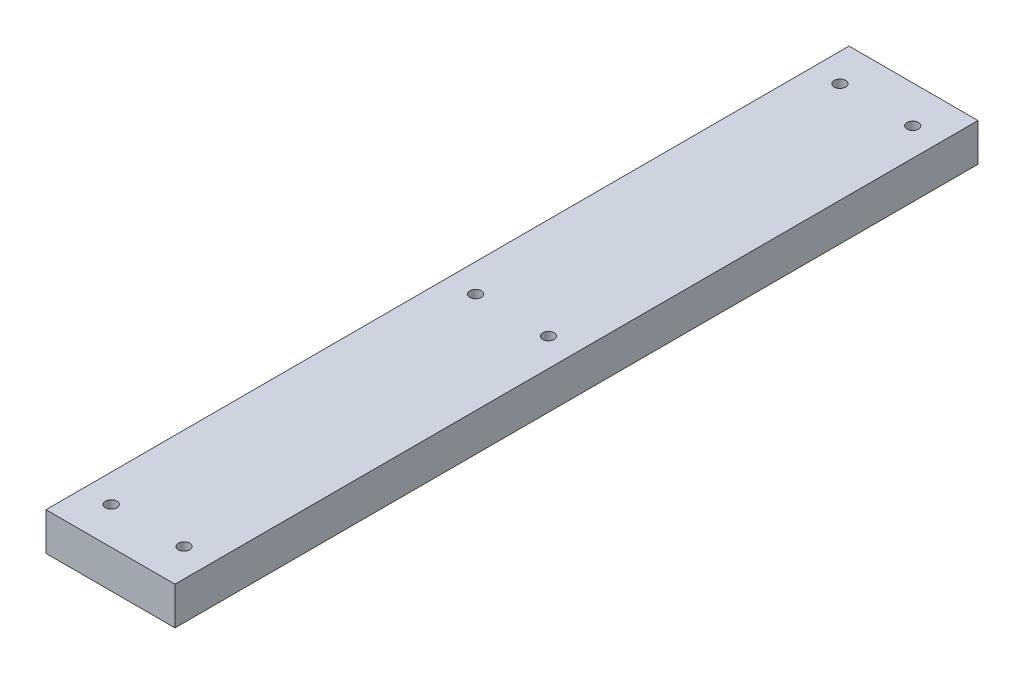
ISO-10303-21;
HEADER;
FILE_DESCRIPTION(('STEP AP214'),'2;1');
FILE_NAME('part.step','',(''),(''),'','','');
FILE_SCHEMA(('AUTOMOTIVE_DESIGN { 1 0 10303 214 1 1 1 1 }'));
ENDSEC;
DATA;
#1=APPLICATION_CONTEXT('core data for automotive mechanical design processes');
#2=APPLICATION_PROTOCOL_DEFINITION('international standard','automotive_design',2000,#1);
#3=PRODUCT_CONTEXT('',#1,'mechanical');
#4=PRODUCT('Part','Part','',(#3));
#5=PRODUCT_RELATED_PRODUCT_CATEGORY('part','',(#4));
#6=PRODUCT_DEFINITION_FORMATION('','',#4);
#7=PRODUCT_DEFINITION_CONTEXT('part definition',#1,'design');
#8=PRODUCT_DEFINITION('design','',#6,#7);
#9=PRODUCT_DEFINITION_SHAPE('','',#8);
#10=(LENGTH_UNIT() NAMED_UNIT(*) SI_UNIT(.MILLI.,.METRE.));
#11=(NAMED_UNIT(*) PLANE_ANGLE_UNIT() SI_UNIT($,.RADIAN.));
#12=(NAMED_UNIT(*) SI_UNIT($,.STERADIAN.) SOLID_ANGLE_UNIT());
#13=UNCERTAINTY_MEASURE_WITH_UNIT(LENGTH_MEASURE(1.E-05),#10,'distance_accuracy_value','');
#14=(GEOMETRIC_REPRESENTATION_CONTEXT(3) GLOBAL_UNCERTAINTY_ASSIGNED_CONTEXT((#13)) GLOBAL_UNIT_ASSIGNED_CONTEXT((#10,
#11,#12)) REPRESENTATION_CONTEXT('',''));
#15=CARTESIAN_POINT('',(0.,0.,0.));
#16=DIRECTION('',(0.,0.,1.));
#17=DIRECTION('',(1.,0.,0.));
#18=AXIS2_PLACEMENT_3D('',#15,#16,#17);
#19=CARTESIAN_POINT('',(-11.2395,6.604,-69.85));
#20=DIRECTION('',(1.,0.,0.));
#21=DIRECTION('',(0.,0.,-1.));
#22=AXIS2_PLACEMENT_3D('',#19,#20,#21);
#23=PLANE('',#22);
#24=DIRECTION('',(0.,0.,1.));
#25=VECTOR('',#24,1.);
#26=CARTESIAN_POINT('',(-11.2395,0.,-69.85));
#27=LINE('',#26,#25);
#28=CARTESIAN_POINT('',(-11.2395,0.,-69.977));
#29=VERTEX_POINT('',#28);
#30=CARTESIAN_POINT('',(-11.2395,0.,69.977));
#31=VERTEX_POINT('',#30);
#32=EDGE_CURVE('E83',#29,#31,#27,.T.);
#33=ORIENTED_EDGE('',*,*,#32,.T.);
#34=DIRECTION('',(0.,-1.,0.));
#35=VECTOR('',#34,1.);
#36=CARTESIAN_POINT('',(-11.2395,6.604,69.977));
#37=LINE('',#36,#35);
#38=CARTESIAN_POINT('',(-11.2395,6.604,69.977));
#39=VERTEX_POINT('',#38);
#40=EDGE_CURVE('E12',#39,#31,#37,.T.);
#41=ORIENTED_EDGE('',*,*,#40,.F.);
#42=DIRECTION('',(0.,0.,1.));
#43=VECTOR('',#42,1.);
#44=CARTESIAN_POINT('',(-11.2395,6.604,-69.85));
#45=LINE('',#44,#43);
#46=CARTESIAN_POINT('',(-11.2395,6.604,-69.977));
#47=VERTEX_POINT('',#46);
#48=EDGE_CURVE('E106',#47,#39,#45,.T.);
#49=ORIENTED_EDGE('',*,*,#48,.F.);
#50=DIRECTION('',(0.,-1.,0.));
#51=VECTOR('',#50,1.);
#52=CARTESIAN_POINT('',(-11.2395,6.604,-69.977));
#53=LINE('',#52,#51);
#54=EDGE_CURVE('E96',#47,#29,#53,.T.);
#55=ORIENTED_EDGE('',*,*,#54,.T.);
#56=EDGE_LOOP('',(#33,#41,#49,#55));
#57=FACE_BOUND('',#56,.T.);
#58=ADVANCED_FACE('F40',(#57),#23,.F.);
#59=CARTESIAN_POINT('',(-11.1125,6.604,69.977));
#60=DIRECTION('',(0.,0.,-1.));
#61=DIRECTION('',(-1.,0.,0.));
#62=AXIS2_PLACEMENT_3D('',#59,#60,#61);
#63=PLANE('',#62);
#64=DIRECTION('',(1.,0.,0.));
#65=VECTOR('',#64,1.);
#66=CARTESIAN_POINT('',(-11.1125,0.,69.977));
#67=LINE('',#66,#65);
#68=CARTESIAN_POINT('',(11.2395,0.,69.977));
#69=VERTEX_POINT('',#68);
#70=EDGE_CURVE('E79',#31,#69,#67,.T.);
#71=ORIENTED_EDGE('',*,*,#70,.T.);
#72=DIRECTION('',(0.,-1.,0.));
#73=VECTOR('',#72,1.);
#74=CARTESIAN_POINT('',(11.2395,6.604,69.9769999999999));
#75=LINE('',#74,#73);
#76=CARTESIAN_POINT('',(11.2395,6.604,69.977));
#77=VERTEX_POINT('',#76);
#78=EDGE_CURVE('E50',#77,#69,#75,.T.);
#79=ORIENTED_EDGE('',*,*,#78,.F.);
#80=DIRECTION('',(1.,0.,0.));
#81=VECTOR('',#80,1.);
#82=CARTESIAN_POINT('',(-11.1125,6.604,69.977));
#83=LINE('',#82,#81);
#84=EDGE_CURVE('E92',#39,#77,#83,.T.);
#85=ORIENTED_EDGE('',*,*,#84,.F.);
#86=ORIENTED_EDGE('',*,*,#40,.T.);
#87=EDGE_LOOP('',(#71,#79,#85,#86));
#88=FACE_BOUND('',#87,.T.);
#89=ADVANCED_FACE('F91',(#88),#63,.F.);
#90=CARTESIAN_POINT('',(11.2395,6.604,-69.85));
#91=DIRECTION('',(-1.,0.,0.));
#92=DIRECTION('',(0.,0.,1.));
#93=AXIS2_PLACEMENT_3D('',#90,#91,#92);
#94=PLANE('',#93);
#95=DIRECTION('',(0.,0.,-1.));
#96=VECTOR('',#95,1.);
#97=CARTESIAN_POINT('',(11.2395,0.,-69.85));
#98=LINE('',#97,#96);
#99=CARTESIAN_POINT('',(11.2395,0.,-69.977));
#100=VERTEX_POINT('',#99);
#101=EDGE_CURVE('E84',#69,#100,#98,.T.);
#102=ORIENTED_EDGE('',*,*,#101,.T.);
#103=DIRECTION('',(0.,-1.,0.));
#104=VECTOR('',#103,1.);
#105=CARTESIAN_POINT('',(11.2395,6.604,-69.977));
#106=LINE('',#105,#104);
#107=CARTESIAN_POINT('',(11.2395,6.604,-69.977));
#108=VERTEX_POINT('',#107);
#109=EDGE_CURVE('E187',#108,#100,#106,.T.);
#110=ORIENTED_EDGE('',*,*,#109,.F.);
#111=DIRECTION('',(0.,0.,-1.));
#112=VECTOR('',#111,1.);
#113=CARTESIAN_POINT('',(11.2395,6.604,-69.85));
#114=LINE('',#113,#112);
#115=EDGE_CURVE('E109',#77,#108,#114,.T.);
#116=ORIENTED_EDGE('',*,*,#115,.F.);
#117=ORIENTED_EDGE('',*,*,#78,.T.);
#118=EDGE_LOOP('',(#102,#110,#116,#117));
#119=FACE_BOUND('',#118,.T.);
#120=ADVANCED_FACE('F42',(#119),#94,.F.);
#121=CARTESIAN_POINT('',(-11.1125,6.604,-69.977));
#122=DIRECTION('',(0.,0.,1.));
#123=DIRECTION('',(1.,0.,0.));
#124=AXIS2_PLACEMENT_3D('',#121,#122,#123);
#125=PLANE('',#124);
#126=DIRECTION('',(-1.,0.,0.));
#127=VECTOR('',#126,1.);
#128=CARTESIAN_POINT('',(-11.1125,0.,-69.977));
#129=LINE('',#128,#127);
#130=EDGE_CURVE('E104',#100,#29,#129,.T.);
#131=ORIENTED_EDGE('',*,*,#130,.T.);
#132=ORIENTED_EDGE('',*,*,#54,.F.);
#133=DIRECTION('',(-1.,0.,0.));
#134=VECTOR('',#133,1.);
#135=CARTESIAN_POINT('',(-11.1125,6.604,-69.977));
#136=LINE('',#135,#134);
#137=EDGE_CURVE('E58',#108,#47,#136,.T.);
#138=ORIENTED_EDGE('',*,*,#137,.F.);
#139=ORIENTED_EDGE('',*,*,#109,.T.);
#140=EDGE_LOOP('',(#131,#132,#138,#139));
#141=FACE_BOUND('',#140,.T.);
#142=ADVANCED_FACE('F174',(#141),#125,.F.);
#143=CARTESIAN_POINT('',(0.,6.604,0.));
#144=DIRECTION('',(0.,1.,0.));
#145=DIRECTION('',(0.,0.,1.));
#146=AXIS2_PLACEMENT_3D('',#143,#144,#145);
#147=PLANE('',#146);
#148=CARTESIAN_POINT('',(6.34999999999999,6.604,-63.5));
#149=DIRECTION('',(0.,1.,0.));
#150=DIRECTION('',(0.,0.,1.));
#151=AXIS2_PLACEMENT_3D('',#148,#149,#150);
#152=CIRCLE('',#151,1.0033);
#153=CARTESIAN_POINT('',(6.34999999999999,6.604,-62.4967));
#154=VERTEX_POINT('',#153);
#155=EDGE_CURVE('E113',#154,#154,#152,.T.);
#156=ORIENTED_EDGE('',*,*,#155,.F.);
#157=EDGE_LOOP('',(#156));
#158=FACE_BOUND('',#157,.T.);
#159=CARTESIAN_POINT('',(6.34999999999999,6.604,0.));
#160=DIRECTION('',(0.,1.,0.));
#161=DIRECTION('',(0.,0.,1.));
#162=AXIS2_PLACEMENT_3D('',#159,#160,#161);
#163=CIRCLE('',#162,1.0033);
#164=CARTESIAN_POINT('',(6.34999999999999,6.604,1.00330000000001));
#165=VERTEX_POINT('',#164);
#166=EDGE_CURVE('E119',#165,#165,#163,.T.);
#167=ORIENTED_EDGE('',*,*,#166,.F.);
#168=EDGE_LOOP('',(#167));
#169=FACE_BOUND('',#168,.T.);
#170=CARTESIAN_POINT('',(6.34999999999999,6.604,63.5));
#171=DIRECTION('',(0.,1.,0.));
#172=DIRECTION('',(0.,0.,1.));
#173=AXIS2_PLACEMENT_3D('',#170,#171,#172);
#174=CIRCLE('',#173,1.0033);
#175=CARTESIAN_POINT('',(6.34999999999999,6.604,64.5033));
#176=VERTEX_POINT('',#175);
#177=EDGE_CURVE('E131',#176,#176,#174,.T.);
#178=ORIENTED_EDGE('',*,*,#177,.F.);
#179=EDGE_LOOP('',(#178));
#180=FACE_BOUND('',#179,.T.);
#181=CARTESIAN_POINT('',(-6.35,6.604,-63.5));
#182=DIRECTION('',(0.,1.,0.));
#183=DIRECTION('',(0.,0.,1.));
#184=AXIS2_PLACEMENT_3D('',#181,#182,#183);
#185=CIRCLE('',#184,1.0033);
#186=CARTESIAN_POINT('',(-6.35,6.604,-62.4967));
#187=VERTEX_POINT('',#186);
#188=EDGE_CURVE('E120',#187,#187,#185,.T.);
#189=ORIENTED_EDGE('',*,*,#188,.F.);
#190=EDGE_LOOP('',(#189));
#191=FACE_BOUND('',#190,.T.);
#192=CARTESIAN_POINT('',(-6.35,6.604,0.));
#193=DIRECTION('',(0.,1.,0.));
#194=DIRECTION('',(0.,0.,1.));
#195=AXIS2_PLACEMENT_3D('',#192,#193,#194);
#196=CIRCLE('',#195,1.0033);
#197=CARTESIAN_POINT('',(-6.35,6.604,1.00330000000001));
#198=VERTEX_POINT('',#197);
#199=EDGE_CURVE('E127',#198,#198,#196,.T.);
#200=ORIENTED_EDGE('',*,*,#199,.F.);
#201=EDGE_LOOP('',(#200));
#202=FACE_BOUND('',#201,.T.);
#203=CARTESIAN_POINT('',(-6.35,6.604,63.5));
#204=DIRECTION('',(0.,1.,0.));
#205=DIRECTION('',(0.,0.,1.));
#206=AXIS2_PLACEMENT_3D('',#203,#204,#205);
#207=CIRCLE('',#206,1.0033);
#208=CARTESIAN_POINT('',(-6.35,6.604,64.5033));
#209=VERTEX_POINT('',#208);
#210=EDGE_CURVE('E100',#209,#209,#207,.T.);
#211=ORIENTED_EDGE('',*,*,#210,.F.);
#212=EDGE_LOOP('',(#211));
#213=FACE_BOUND('',#212,.T.);
#214=ORIENTED_EDGE('',*,*,#48,.T.);
#215=ORIENTED_EDGE('',*,*,#84,.T.);
#216=ORIENTED_EDGE('',*,*,#115,.T.);
#217=ORIENTED_EDGE('',*,*,#137,.T.);
#218=EDGE_LOOP('',(#214,#215,#216,#217));
#219=FACE_BOUND('',#218,.T.);
#220=ADVANCED_FACE('F176',(#158,#169,#180,#191,#202,#213,#219),#147,.T.);
#221=CARTESIAN_POINT('',(0.,0.,0.));
#222=DIRECTION('',(0.,1.,0.));
#223=DIRECTION('',(0.,0.,1.));
#224=AXIS2_PLACEMENT_3D('',#221,#222,#223);
#225=PLANE('',#224);
#226=CARTESIAN_POINT('',(6.34999999999999,0.,-63.5));
#227=DIRECTION('',(0.,1.,0.));
#228=DIRECTION('',(0.,0.,1.));
#229=AXIS2_PLACEMENT_3D('',#226,#227,#228);
#230=CIRCLE('',#229,1.0033);
#231=CARTESIAN_POINT('',(6.34999999999999,0.,-62.4967));
#232=VERTEX_POINT('',#231);
#233=EDGE_CURVE('E116',#232,#232,#230,.T.);
#234=ORIENTED_EDGE('',*,*,#233,.T.);
#235=EDGE_LOOP('',(#234));
#236=FACE_BOUND('',#235,.T.);
#237=CARTESIAN_POINT('',(6.34999999999999,0.,0.));
#238=DIRECTION('',(0.,1.,0.));
#239=DIRECTION('',(0.,0.,1.));
#240=AXIS2_PLACEMENT_3D('',#237,#238,#239);
#241=CIRCLE('',#240,1.0033);
#242=CARTESIAN_POINT('',(6.34999999999999,0.,1.00330000000001));
#243=VERTEX_POINT('',#242);
#244=EDGE_CURVE('E44',#243,#243,#241,.T.);
#245=ORIENTED_EDGE('',*,*,#244,.T.);
#246=EDGE_LOOP('',(#245));
#247=FACE_BOUND('',#246,.T.);
#248=CARTESIAN_POINT('',(6.34999999999999,0.,63.5));
#249=DIRECTION('',(0.,1.,0.));
#250=DIRECTION('',(0.,0.,1.));
#251=AXIS2_PLACEMENT_3D('',#248,#249,#250);
#252=CIRCLE('',#251,1.0033);
#253=CARTESIAN_POINT('',(6.34999999999999,0.,64.5033));
#254=VERTEX_POINT('',#253);
#255=EDGE_CURVE('E124',#254,#254,#252,.T.);
#256=ORIENTED_EDGE('',*,*,#255,.T.);
#257=EDGE_LOOP('',(#256));
#258=FACE_BOUND('',#257,.T.);
#259=CARTESIAN_POINT('',(-6.35,0.,-63.5));
#260=DIRECTION('',(0.,1.,0.));
#261=DIRECTION('',(0.,0.,1.));
#262=AXIS2_PLACEMENT_3D('',#259,#260,#261);
#263=CIRCLE('',#262,1.0033);
#264=CARTESIAN_POINT('',(-6.35,0.,-62.4967));
#265=VERTEX_POINT('',#264);
#266=EDGE_CURVE('E123',#265,#265,#263,.T.);
#267=ORIENTED_EDGE('',*,*,#266,.T.);
#268=EDGE_LOOP('',(#267));
#269=FACE_BOUND('',#268,.T.);
#270=CARTESIAN_POINT('',(-6.35,0.,0.));
#271=DIRECTION('',(0.,1.,0.));
#272=DIRECTION('',(0.,0.,1.));
#273=AXIS2_PLACEMENT_3D('',#270,#271,#272);
#274=CIRCLE('',#273,1.0033);
#275=CARTESIAN_POINT('',(-6.35,0.,1.00330000000001));
#276=VERTEX_POINT('',#275);
#277=EDGE_CURVE('E129',#276,#276,#274,.T.);
#278=ORIENTED_EDGE('',*,*,#277,.T.);
#279=EDGE_LOOP('',(#278));
#280=FACE_BOUND('',#279,.T.);
#281=CARTESIAN_POINT('',(-6.35,0.,63.5));
#282=DIRECTION('',(0.,1.,0.));
#283=DIRECTION('',(0.,0.,1.));
#284=AXIS2_PLACEMENT_3D('',#281,#282,#283);
#285=CIRCLE('',#284,1.0033);
#286=CARTESIAN_POINT('',(-6.35,0.,64.5033));
#287=VERTEX_POINT('',#286);
#288=EDGE_CURVE('E97',#287,#287,#285,.T.);
#289=ORIENTED_EDGE('',*,*,#288,.T.);
#290=EDGE_LOOP('',(#289));
#291=FACE_BOUND('',#290,.T.);
#292=ORIENTED_EDGE('',*,*,#32,.F.);
#293=ORIENTED_EDGE('',*,*,#130,.F.);
#294=ORIENTED_EDGE('',*,*,#101,.F.);
#295=ORIENTED_EDGE('',*,*,#70,.F.);
#296=EDGE_LOOP('',(#292,#293,#294,#295));
#297=FACE_BOUND('',#296,.T.);
#298=ADVANCED_FACE('F80',(#236,#247,#258,#269,#280,#291,#297),#225,.F.);
#299=CARTESIAN_POINT('',(-6.35,6.604,63.5));
#300=DIRECTION('',(0.,1.,0.));
#301=DIRECTION('',(0.,0.,1.));
#302=AXIS2_PLACEMENT_3D('',#299,#300,#301);
#303=CYLINDRICAL_SURFACE('',#302,1.0033);
#304=ORIENTED_EDGE('',*,*,#210,.T.);
#305=EDGE_LOOP('',(#304));
#306=FACE_BOUND('',#305,.T.);
#307=ORIENTED_EDGE('',*,*,#288,.F.);
#308=EDGE_LOOP('',(#307));
#309=FACE_BOUND('',#308,.T.);
#310=ADVANCED_FACE('F170',(#306,#309),#303,.F.);
#311=CARTESIAN_POINT('',(-6.35,6.604,0.));
#312=DIRECTION('',(0.,1.,0.));
#313=DIRECTION('',(0.,0.,1.));
#314=AXIS2_PLACEMENT_3D('',#311,#312,#313);
#315=CYLINDRICAL_SURFACE('',#314,1.0033);
#316=ORIENTED_EDGE('',*,*,#199,.T.);
#317=EDGE_LOOP('',(#316));
#318=FACE_BOUND('',#317,.T.);
#319=ORIENTED_EDGE('',*,*,#277,.F.);
#320=EDGE_LOOP('',(#319));
#321=FACE_BOUND('',#320,.T.);
#322=ADVANCED_FACE('F172',(#318,#321),#315,.F.);
#323=CARTESIAN_POINT('',(-6.35,6.604,-63.5));
#324=DIRECTION('',(0.,1.,0.));
#325=DIRECTION('',(0.,0.,1.));
#326=AXIS2_PLACEMENT_3D('',#323,#324,#325);
#327=CYLINDRICAL_SURFACE('',#326,1.0033);
#328=ORIENTED_EDGE('',*,*,#188,.T.);
#329=EDGE_LOOP('',(#328));
#330=FACE_BOUND('',#329,.T.);
#331=ORIENTED_EDGE('',*,*,#266,.F.);
#332=EDGE_LOOP('',(#331));
#333=FACE_BOUND('',#332,.T.);
#334=ADVANCED_FACE('F158',(#330,#333),#327,.F.);
#335=CARTESIAN_POINT('',(6.34999999999999,6.604,63.5));
#336=DIRECTION('',(0.,1.,0.));
#337=DIRECTION('',(0.,0.,1.));
#338=AXIS2_PLACEMENT_3D('',#335,#336,#337);
#339=CYLINDRICAL_SURFACE('',#338,1.0033);
#340=ORIENTED_EDGE('',*,*,#177,.T.);
#341=EDGE_LOOP('',(#340));
#342=FACE_BOUND('',#341,.T.);
#343=ORIENTED_EDGE('',*,*,#255,.F.);
#344=EDGE_LOOP('',(#343));
#345=FACE_BOUND('',#344,.T.);
#346=ADVANCED_FACE('F150',(#342,#345),#339,.F.);
#347=CARTESIAN_POINT('',(6.34999999999999,6.604,0.));
#348=DIRECTION('',(0.,1.,0.));
#349=DIRECTION('',(0.,0.,1.));
#350=AXIS2_PLACEMENT_3D('',#347,#348,#349);
#351=CYLINDRICAL_SURFACE('',#350,1.0033);
#352=ORIENTED_EDGE('',*,*,#166,.T.);
#353=EDGE_LOOP('',(#352));
#354=FACE_BOUND('',#353,.T.);
#355=ORIENTED_EDGE('',*,*,#244,.F.);
#356=EDGE_LOOP('',(#355));
#357=FACE_BOUND('',#356,.T.);
#358=ADVANCED_FACE('F147',(#354,#357),#351,.F.);
#359=CARTESIAN_POINT('',(6.34999999999999,6.604,-63.5));
#360=DIRECTION('',(0.,1.,0.));
#361=DIRECTION('',(0.,0.,1.));
#362=AXIS2_PLACEMENT_3D('',#359,#360,#361);
#363=CYLINDRICAL_SURFACE('',#362,1.0033);
#364=ORIENTED_EDGE('',*,*,#155,.T.);
#365=EDGE_LOOP('',(#364));
#366=FACE_BOUND('',#365,.T.);
#367=ORIENTED_EDGE('',*,*,#233,.F.);
#368=EDGE_LOOP('',(#367));
#369=FACE_BOUND('',#368,.T.);
#370=ADVANCED_FACE('F149',(#366,#369),#363,.F.);
#371=CLOSED_SHELL('',(#58,#89,#120,#142,#220,#298,#310,#322,#334,#346,#358,#370));
#372=MANIFOLD_SOLID_BREP('B2',#371);
#373=ADVANCED_BREP_SHAPE_REPRESENTATION('',(#18,#372),#14);
#374=SHAPE_DEFINITION_REPRESENTATION(#9,#373);
ENDSEC;
END-ISO-10303-21;
